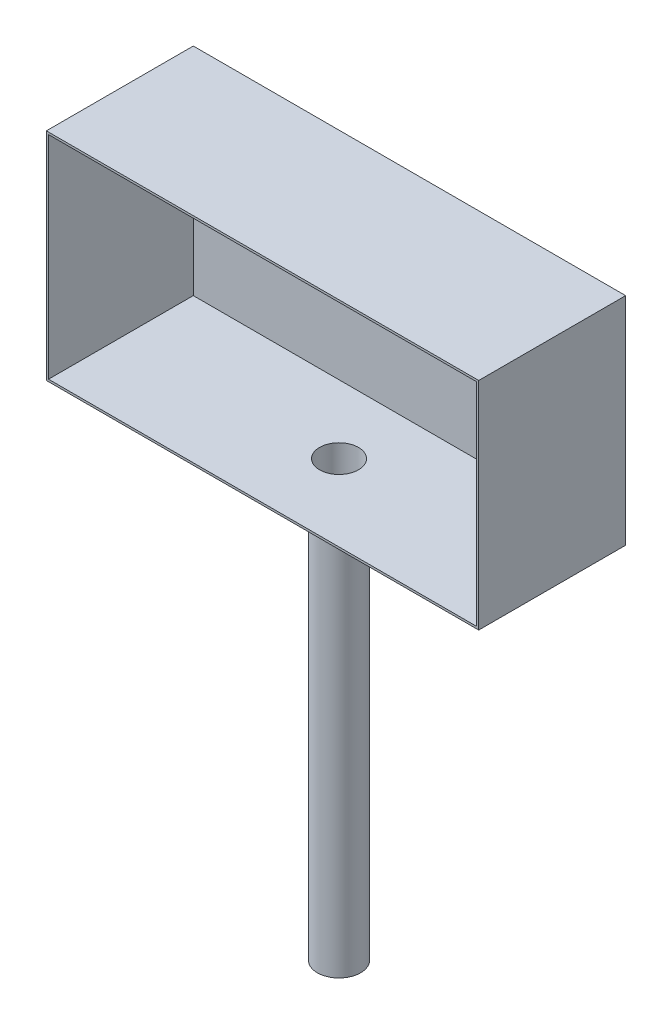
ISO-10303-21;
HEADER;
FILE_DESCRIPTION(('STEP AP214'),'2;1');
FILE_NAME('part.step','',(''),(''),'','','');
FILE_SCHEMA(('AUTOMOTIVE_DESIGN { 1 0 10303 214 1 1 1 1 }'));
ENDSEC;
DATA;
#1=APPLICATION_CONTEXT('core data for automotive mechanical design processes');
#2=APPLICATION_PROTOCOL_DEFINITION('international standard','automotive_design',2000,#1);
#3=PRODUCT_CONTEXT('',#1,'mechanical');
#4=PRODUCT('Part','Part','',(#3));
#5=PRODUCT_RELATED_PRODUCT_CATEGORY('part','',(#4));
#6=PRODUCT_DEFINITION_FORMATION('','',#4);
#7=PRODUCT_DEFINITION_CONTEXT('part definition',#1,'design');
#8=PRODUCT_DEFINITION('design','',#6,#7);
#9=PRODUCT_DEFINITION_SHAPE('','',#8);
#10=(LENGTH_UNIT() NAMED_UNIT(*) SI_UNIT(.MILLI.,.METRE.));
#11=(NAMED_UNIT(*) PLANE_ANGLE_UNIT() SI_UNIT($,.RADIAN.));
#12=(NAMED_UNIT(*) SI_UNIT($,.STERADIAN.) SOLID_ANGLE_UNIT());
#13=UNCERTAINTY_MEASURE_WITH_UNIT(LENGTH_MEASURE(1.E-05),#10,'distance_accuracy_value','');
#14=(GEOMETRIC_REPRESENTATION_CONTEXT(3) GLOBAL_UNCERTAINTY_ASSIGNED_CONTEXT((#13)) GLOBAL_UNIT_ASSIGNED_CONTEXT((#10,
#11,#12)) REPRESENTATION_CONTEXT('',''));
#15=CARTESIAN_POINT('',(0.,0.,0.));
#16=DIRECTION('',(0.,0.,1.));
#17=DIRECTION('',(1.,0.,0.));
#18=AXIS2_PLACEMENT_3D('',#15,#16,#17);
#19=CARTESIAN_POINT('',(1000.,2000.,353.719295440715));
#20=DIRECTION('',(0.,0.,-1.));
#21=DIRECTION('',(0.,1.,0.));
#22=AXIS2_PLACEMENT_3D('',#19,#20,#21);
#23=PLANE('',#22);
#24=DIRECTION('',(0.,-1.,0.));
#25=VECTOR('',#24,1.);
#26=CARTESIAN_POINT('',(-1000.,2000.,353.719295440715));
#27=LINE('',#26,#25);
#28=CARTESIAN_POINT('',(-1000.,3000.,353.719295440714));
#29=VERTEX_POINT('',#28);
#30=CARTESIAN_POINT('',(-1000.,2000.,353.719295440715));
#31=VERTEX_POINT('',#30);
#32=EDGE_CURVE('E84',#29,#31,#27,.T.);
#33=ORIENTED_EDGE('',*,*,#32,.T.);
#34=DIRECTION('',(-1.,0.,0.));
#35=VECTOR('',#34,1.);
#36=CARTESIAN_POINT('',(1000.,2000.,353.719295440715));
#37=LINE('',#36,#35);
#38=CARTESIAN_POINT('',(1000.,2000.,353.719295440715));
#39=VERTEX_POINT('',#38);
#40=EDGE_CURVE('E164',#39,#31,#37,.T.);
#41=ORIENTED_EDGE('',*,*,#40,.F.);
#42=DIRECTION('',(0.,-1.,0.));
#43=VECTOR('',#42,1.);
#44=CARTESIAN_POINT('',(1000.,2000.,353.719295440715));
#45=LINE('',#44,#43);
#46=CARTESIAN_POINT('',(1000.,3000.,353.719295440714));
#47=VERTEX_POINT('',#46);
#48=EDGE_CURVE('E162',#47,#39,#45,.T.);
#49=ORIENTED_EDGE('',*,*,#48,.F.);
#50=DIRECTION('',(-1.,0.,0.));
#51=VECTOR('',#50,1.);
#52=CARTESIAN_POINT('',(1000.,3000.,353.719295440714));
#53=LINE('',#52,#51);
#54=EDGE_CURVE('E172',#47,#29,#53,.T.);
#55=ORIENTED_EDGE('',*,*,#54,.T.);
#56=EDGE_LOOP('',(#33,#41,#49,#55));
#57=FACE_BOUND('',#56,.T.);
#58=DIRECTION('',(0.,-1.,0.));
#59=VECTOR('',#58,1.);
#60=CARTESIAN_POINT('',(-990.,0.,353.719295440715));
#61=LINE('',#60,#59);
#62=CARTESIAN_POINT('',(-990.,2990.,353.719295440714));
#63=VERTEX_POINT('',#62);
#64=CARTESIAN_POINT('',(-990.,2010.,353.719295440715));
#65=VERTEX_POINT('',#64);
#66=EDGE_CURVE('E119',#63,#65,#61,.T.);
#67=ORIENTED_EDGE('',*,*,#66,.F.);
#68=DIRECTION('',(-1.,0.,0.));
#69=VECTOR('',#68,1.);
#70=CARTESIAN_POINT('',(1000.,2990.,353.719295440714));
#71=LINE('',#70,#69);
#72=CARTESIAN_POINT('',(990.,2990.,353.719295440714));
#73=VERTEX_POINT('',#72);
#74=EDGE_CURVE('E142',#73,#63,#71,.T.);
#75=ORIENTED_EDGE('',*,*,#74,.F.);
#76=DIRECTION('',(0.,-1.,0.));
#77=VECTOR('',#76,1.);
#78=CARTESIAN_POINT('',(990.,0.,353.719295440715));
#79=LINE('',#78,#77);
#80=CARTESIAN_POINT('',(990.,2010.,353.719295440715));
#81=VERTEX_POINT('',#80);
#82=EDGE_CURVE('E52',#73,#81,#79,.T.);
#83=ORIENTED_EDGE('',*,*,#82,.T.);
#84=DIRECTION('',(-1.,0.,0.));
#85=VECTOR('',#84,1.);
#86=CARTESIAN_POINT('',(1000.,2010.,353.719295440715));
#87=LINE('',#86,#85);
#88=EDGE_CURVE('E151',#81,#65,#87,.T.);
#89=ORIENTED_EDGE('',*,*,#88,.T.);
#90=EDGE_LOOP('',(#67,#75,#83,#89));
#91=FACE_BOUND('',#90,.T.);
#92=ADVANCED_FACE('F37',(#57,#91),#23,.F.);
#93=CARTESIAN_POINT('',(0.,2000.,0.));
#94=DIRECTION('',(0.,-1.,0.));
#95=DIRECTION('',(0.,0.,-1.));
#96=AXIS2_PLACEMENT_3D('',#93,#94,#95);
#97=CYLINDRICAL_SURFACE('',#96,100.);
#98=CARTESIAN_POINT('',(0.,2000.,0.));
#99=DIRECTION('',(0.,1.,0.));
#100=DIRECTION('',(0.,0.,1.));
#101=AXIS2_PLACEMENT_3D('',#98,#99,#100);
#102=CIRCLE('',#101,100.);
#103=CARTESIAN_POINT('',(0.,2000.,100.));
#104=VERTEX_POINT('',#103);
#105=EDGE_CURVE('E11',#104,#104,#102,.T.);
#106=ORIENTED_EDGE('',*,*,#105,.F.);
#107=EDGE_LOOP('',(#106));
#108=FACE_BOUND('',#107,.T.);
#109=CARTESIAN_POINT('',(0.,0.,0.));
#110=DIRECTION('',(0.,1.,0.));
#111=DIRECTION('',(0.,0.,1.));
#112=AXIS2_PLACEMENT_3D('',#109,#110,#111);
#113=CIRCLE('',#112,100.);
#114=CARTESIAN_POINT('',(0.,0.,100.));
#115=VERTEX_POINT('',#114);
#116=EDGE_CURVE('E41',#115,#115,#113,.T.);
#117=ORIENTED_EDGE('',*,*,#116,.T.);
#118=EDGE_LOOP('',(#117));
#119=FACE_BOUND('',#118,.T.);
#120=ADVANCED_FACE('F39',(#108,#119),#97,.T.);
#121=CARTESIAN_POINT('',(0.,0.,0.));
#122=DIRECTION('',(0.,1.,0.));
#123=DIRECTION('',(0.,0.,1.));
#124=AXIS2_PLACEMENT_3D('',#121,#122,#123);
#125=PLANE('',#124);
#126=ORIENTED_EDGE('',*,*,#116,.F.);
#127=EDGE_LOOP('',(#126));
#128=FACE_BOUND('',#127,.T.);
#129=ADVANCED_FACE('F182',(#128),#125,.F.);
#130=CARTESIAN_POINT('',(1000.,3000.,-325.945022221521));
#131=DIRECTION('',(0.,0.,1.));
#132=DIRECTION('',(0.,-1.,0.));
#133=AXIS2_PLACEMENT_3D('',#130,#131,#132);
#134=PLANE('',#133);
#135=DIRECTION('',(0.,1.,0.));
#136=VECTOR('',#135,1.);
#137=CARTESIAN_POINT('',(-1000.,3000.,-325.945022221521));
#138=LINE('',#137,#136);
#139=CARTESIAN_POINT('',(-1000.,2000.,-325.945022221521));
#140=VERTEX_POINT('',#139);
#141=CARTESIAN_POINT('',(-1000.,3000.,-325.945022221521));
#142=VERTEX_POINT('',#141);
#143=EDGE_CURVE('E165',#140,#142,#138,.T.);
#144=ORIENTED_EDGE('',*,*,#143,.T.);
#145=DIRECTION('',(-1.,0.,0.));
#146=VECTOR('',#145,1.);
#147=CARTESIAN_POINT('',(1000.,3000.,-325.945022221521));
#148=LINE('',#147,#146);
#149=CARTESIAN_POINT('',(1000.,3000.,-325.945022221521));
#150=VERTEX_POINT('',#149);
#151=EDGE_CURVE('E174',#150,#142,#148,.T.);
#152=ORIENTED_EDGE('',*,*,#151,.F.);
#153=DIRECTION('',(0.,1.,0.));
#154=VECTOR('',#153,1.);
#155=CARTESIAN_POINT('',(1000.,3000.,-325.945022221521));
#156=LINE('',#155,#154);
#157=CARTESIAN_POINT('',(1000.,2000.,-325.945022221521));
#158=VERTEX_POINT('',#157);
#159=EDGE_CURVE('E91',#158,#150,#156,.T.);
#160=ORIENTED_EDGE('',*,*,#159,.F.);
#161=DIRECTION('',(-1.,0.,0.));
#162=VECTOR('',#161,1.);
#163=CARTESIAN_POINT('',(1000.,2000.,-325.945022221521));
#164=LINE('',#163,#162);
#165=EDGE_CURVE('E177',#158,#140,#164,.T.);
#166=ORIENTED_EDGE('',*,*,#165,.T.);
#167=EDGE_LOOP('',(#144,#152,#160,#166));
#168=FACE_BOUND('',#167,.T.);
#169=ADVANCED_FACE('F184',(#168),#134,.F.);
#170=CARTESIAN_POINT('',(1000.,3000.,353.719295440714));
#171=DIRECTION('',(0.,-1.,0.));
#172=DIRECTION('',(0.,0.,-1.));
#173=AXIS2_PLACEMENT_3D('',#170,#171,#172);
#174=PLANE('',#173);
#175=DIRECTION('',(0.,0.,1.));
#176=VECTOR('',#175,1.);
#177=CARTESIAN_POINT('',(-1000.,3000.,353.719295440714));
#178=LINE('',#177,#176);
#179=EDGE_CURVE('E167',#142,#29,#178,.T.);
#180=ORIENTED_EDGE('',*,*,#179,.T.);
#181=ORIENTED_EDGE('',*,*,#54,.F.);
#182=DIRECTION('',(0.,0.,1.));
#183=VECTOR('',#182,1.);
#184=CARTESIAN_POINT('',(1000.,3000.,353.719295440714));
#185=LINE('',#184,#183);
#186=EDGE_CURVE('E160',#150,#47,#185,.T.);
#187=ORIENTED_EDGE('',*,*,#186,.F.);
#188=ORIENTED_EDGE('',*,*,#151,.T.);
#189=EDGE_LOOP('',(#180,#181,#187,#188));
#190=FACE_BOUND('',#189,.T.);
#191=ADVANCED_FACE('F189',(#190),#174,.F.);
#192=CARTESIAN_POINT('',(1000.,2000.,0.));
#193=DIRECTION('',(0.,1.,0.));
#194=DIRECTION('',(0.,0.,1.));
#195=AXIS2_PLACEMENT_3D('',#192,#193,#194);
#196=PLANE('',#195);
#197=ORIENTED_EDGE('',*,*,#105,.T.);
#198=EDGE_LOOP('',(#197));
#199=FACE_BOUND('',#198,.T.);
#200=DIRECTION('',(0.,0.,-1.));
#201=VECTOR('',#200,1.);
#202=CARTESIAN_POINT('',(-1000.,2000.,0.));
#203=LINE('',#202,#201);
#204=EDGE_CURVE('E158',#31,#140,#203,.T.);
#205=ORIENTED_EDGE('',*,*,#204,.T.);
#206=ORIENTED_EDGE('',*,*,#165,.F.);
#207=DIRECTION('',(0.,0.,-1.));
#208=VECTOR('',#207,1.);
#209=CARTESIAN_POINT('',(1000.,2000.,-325.945022221521));
#210=LINE('',#209,#208);
#211=EDGE_CURVE('E61',#39,#158,#210,.T.);
#212=ORIENTED_EDGE('',*,*,#211,.F.);
#213=ORIENTED_EDGE('',*,*,#40,.T.);
#214=EDGE_LOOP('',(#205,#206,#212,#213));
#215=FACE_BOUND('',#214,.T.);
#216=ADVANCED_FACE('F199',(#199,#215),#196,.F.);
#217=CARTESIAN_POINT('',(1000.,0.,0.));
#218=DIRECTION('',(-1.,0.,0.));
#219=DIRECTION('',(0.,0.,1.));
#220=AXIS2_PLACEMENT_3D('',#217,#218,#219);
#221=PLANE('',#220);
#222=ORIENTED_EDGE('',*,*,#211,.T.);
#223=ORIENTED_EDGE('',*,*,#159,.T.);
#224=ORIENTED_EDGE('',*,*,#186,.T.);
#225=ORIENTED_EDGE('',*,*,#48,.T.);
#226=EDGE_LOOP('',(#222,#223,#224,#225));
#227=FACE_BOUND('',#226,.T.);
#228=ADVANCED_FACE('F206',(#227),#221,.F.);
#229=CARTESIAN_POINT('',(-1000.,0.,0.));
#230=DIRECTION('',(-1.,0.,0.));
#231=DIRECTION('',(0.,0.,1.));
#232=AXIS2_PLACEMENT_3D('',#229,#230,#231);
#233=PLANE('',#232);
#234=ORIENTED_EDGE('',*,*,#143,.F.);
#235=ORIENTED_EDGE('',*,*,#204,.F.);
#236=ORIENTED_EDGE('',*,*,#32,.F.);
#237=ORIENTED_EDGE('',*,*,#179,.F.);
#238=EDGE_LOOP('',(#234,#235,#236,#237));
#239=FACE_BOUND('',#238,.T.);
#240=ADVANCED_FACE('F215',(#239),#233,.T.);
#241=CARTESIAN_POINT('',(0.,2000.,0.));
#242=DIRECTION('',(0.,-1.,0.));
#243=DIRECTION('',(0.,0.,-1.));
#244=AXIS2_PLACEMENT_3D('',#241,#242,#243);
#245=CYLINDRICAL_SURFACE('',#244,90.);
#246=CARTESIAN_POINT('',(0.,2010.,0.));
#247=DIRECTION('',(0.,1.,0.));
#248=DIRECTION('',(0.,0.,1.));
#249=AXIS2_PLACEMENT_3D('',#246,#247,#248);
#250=CIRCLE('',#249,90.);
#251=CARTESIAN_POINT('',(0.,2010.,90.));
#252=VERTEX_POINT('',#251);
#253=EDGE_CURVE('E140',#252,#252,#250,.T.);
#254=ORIENTED_EDGE('',*,*,#253,.T.);
#255=EDGE_LOOP('',(#254));
#256=FACE_BOUND('',#255,.T.);
#257=CARTESIAN_POINT('',(0.,10.,0.));
#258=DIRECTION('',(0.,1.,0.));
#259=DIRECTION('',(0.,0.,1.));
#260=AXIS2_PLACEMENT_3D('',#257,#258,#259);
#261=CIRCLE('',#260,90.);
#262=CARTESIAN_POINT('',(0.,10.,90.));
#263=VERTEX_POINT('',#262);
#264=EDGE_CURVE('E137',#263,#263,#261,.T.);
#265=ORIENTED_EDGE('',*,*,#264,.F.);
#266=EDGE_LOOP('',(#265));
#267=FACE_BOUND('',#266,.T.);
#268=ADVANCED_FACE('F222',(#256,#267),#245,.F.);
#269=CARTESIAN_POINT('',(0.,10.,0.));
#270=DIRECTION('',(0.,1.,0.));
#271=DIRECTION('',(0.,0.,1.));
#272=AXIS2_PLACEMENT_3D('',#269,#270,#271);
#273=PLANE('',#272);
#274=ORIENTED_EDGE('',*,*,#264,.T.);
#275=EDGE_LOOP('',(#274));
#276=FACE_BOUND('',#275,.T.);
#277=ADVANCED_FACE('F238',(#276),#273,.T.);
#278=CARTESIAN_POINT('',(1000.,3000.,-315.945022221521));
#279=DIRECTION('',(0.,0.,1.));
#280=DIRECTION('',(0.,-1.,0.));
#281=AXIS2_PLACEMENT_3D('',#278,#279,#280);
#282=PLANE('',#281);
#283=DIRECTION('',(0.,1.,0.));
#284=VECTOR('',#283,1.);
#285=CARTESIAN_POINT('',(-990.,0.,-315.945022221522));
#286=LINE('',#285,#284);
#287=CARTESIAN_POINT('',(-990.,2010.,-315.945022221521));
#288=VERTEX_POINT('',#287);
#289=CARTESIAN_POINT('',(-990.,2990.,-315.945022221521));
#290=VERTEX_POINT('',#289);
#291=EDGE_CURVE('E116',#288,#290,#286,.T.);
#292=ORIENTED_EDGE('',*,*,#291,.F.);
#293=DIRECTION('',(-1.,0.,0.));
#294=VECTOR('',#293,1.);
#295=CARTESIAN_POINT('',(1000.,2010.,-315.945022221521));
#296=LINE('',#295,#294);
#297=CARTESIAN_POINT('',(990.,2010.,-315.945022221521));
#298=VERTEX_POINT('',#297);
#299=EDGE_CURVE('E129',#298,#288,#296,.T.);
#300=ORIENTED_EDGE('',*,*,#299,.F.);
#301=DIRECTION('',(0.,1.,0.));
#302=VECTOR('',#301,1.);
#303=CARTESIAN_POINT('',(990.,0.,-315.945022221522));
#304=LINE('',#303,#302);
#305=CARTESIAN_POINT('',(990.,2990.,-315.945022221521));
#306=VERTEX_POINT('',#305);
#307=EDGE_CURVE('E145',#298,#306,#304,.T.);
#308=ORIENTED_EDGE('',*,*,#307,.T.);
#309=DIRECTION('',(-1.,0.,0.));
#310=VECTOR('',#309,1.);
#311=CARTESIAN_POINT('',(1000.,2990.,-315.945022221521));
#312=LINE('',#311,#310);
#313=EDGE_CURVE('E131',#306,#290,#312,.T.);
#314=ORIENTED_EDGE('',*,*,#313,.T.);
#315=EDGE_LOOP('',(#292,#300,#308,#314));
#316=FACE_BOUND('',#315,.T.);
#317=ADVANCED_FACE('F128',(#316),#282,.T.);
#318=CARTESIAN_POINT('',(1000.,2990.,353.719295440714));
#319=DIRECTION('',(0.,-1.,0.));
#320=DIRECTION('',(0.,0.,-1.));
#321=AXIS2_PLACEMENT_3D('',#318,#319,#320);
#322=PLANE('',#321);
#323=DIRECTION('',(0.,0.,1.));
#324=VECTOR('',#323,1.);
#325=CARTESIAN_POINT('',(-990.,2990.,0.));
#326=LINE('',#325,#324);
#327=EDGE_CURVE('E133',#290,#63,#326,.T.);
#328=ORIENTED_EDGE('',*,*,#327,.F.);
#329=ORIENTED_EDGE('',*,*,#313,.F.);
#330=DIRECTION('',(0.,0.,1.));
#331=VECTOR('',#330,1.);
#332=CARTESIAN_POINT('',(990.,2990.,0.));
#333=LINE('',#332,#331);
#334=EDGE_CURVE('E148',#306,#73,#333,.T.);
#335=ORIENTED_EDGE('',*,*,#334,.T.);
#336=ORIENTED_EDGE('',*,*,#74,.T.);
#337=EDGE_LOOP('',(#328,#329,#335,#336));
#338=FACE_BOUND('',#337,.T.);
#339=ADVANCED_FACE('F231',(#338),#322,.T.);
#340=CARTESIAN_POINT('',(1000.,2010.,0.));
#341=DIRECTION('',(0.,1.,0.));
#342=DIRECTION('',(0.,0.,1.));
#343=AXIS2_PLACEMENT_3D('',#340,#341,#342);
#344=PLANE('',#343);
#345=ORIENTED_EDGE('',*,*,#253,.F.);
#346=EDGE_LOOP('',(#345));
#347=FACE_BOUND('',#346,.T.);
#348=DIRECTION('',(0.,0.,-1.));
#349=VECTOR('',#348,1.);
#350=CARTESIAN_POINT('',(-990.,2010.,0.));
#351=LINE('',#350,#349);
#352=EDGE_CURVE('E113',#65,#288,#351,.T.);
#353=ORIENTED_EDGE('',*,*,#352,.F.);
#354=ORIENTED_EDGE('',*,*,#88,.F.);
#355=DIRECTION('',(0.,0.,-1.));
#356=VECTOR('',#355,1.);
#357=CARTESIAN_POINT('',(990.,2010.,0.));
#358=LINE('',#357,#356);
#359=EDGE_CURVE('E124',#81,#298,#358,.T.);
#360=ORIENTED_EDGE('',*,*,#359,.T.);
#361=ORIENTED_EDGE('',*,*,#299,.T.);
#362=EDGE_LOOP('',(#353,#354,#360,#361));
#363=FACE_BOUND('',#362,.T.);
#364=ADVANCED_FACE('F136',(#347,#363),#344,.T.);
#365=CARTESIAN_POINT('',(990.,0.,0.));
#366=DIRECTION('',(-1.,0.,0.));
#367=DIRECTION('',(0.,0.,1.));
#368=AXIS2_PLACEMENT_3D('',#365,#366,#367);
#369=PLANE('',#368);
#370=ORIENTED_EDGE('',*,*,#359,.F.);
#371=ORIENTED_EDGE('',*,*,#82,.F.);
#372=ORIENTED_EDGE('',*,*,#334,.F.);
#373=ORIENTED_EDGE('',*,*,#307,.F.);
#374=EDGE_LOOP('',(#370,#371,#372,#373));
#375=FACE_BOUND('',#374,.T.);
#376=ADVANCED_FACE('F226',(#375),#369,.T.);
#377=CARTESIAN_POINT('',(-990.,0.,0.));
#378=DIRECTION('',(-1.,0.,0.));
#379=DIRECTION('',(0.,0.,1.));
#380=AXIS2_PLACEMENT_3D('',#377,#378,#379);
#381=PLANE('',#380);
#382=ORIENTED_EDGE('',*,*,#291,.T.);
#383=ORIENTED_EDGE('',*,*,#327,.T.);
#384=ORIENTED_EDGE('',*,*,#66,.T.);
#385=ORIENTED_EDGE('',*,*,#352,.T.);
#386=EDGE_LOOP('',(#382,#383,#384,#385));
#387=FACE_BOUND('',#386,.T.);
#388=ADVANCED_FACE('F115',(#387),#381,.F.);
#389=CLOSED_SHELL('',(#92,#120,#129,#169,#191,#216,#228,#240,#268,#277,#317,#339,#364,#376,#388));
#390=MANIFOLD_SOLID_BREP('B2',#389);
#391=ADVANCED_BREP_SHAPE_REPRESENTATION('',(#18,#390),#14);
#392=SHAPE_DEFINITION_REPRESENTATION(#9,#391);
ENDSEC;
END-ISO-10303-21;
